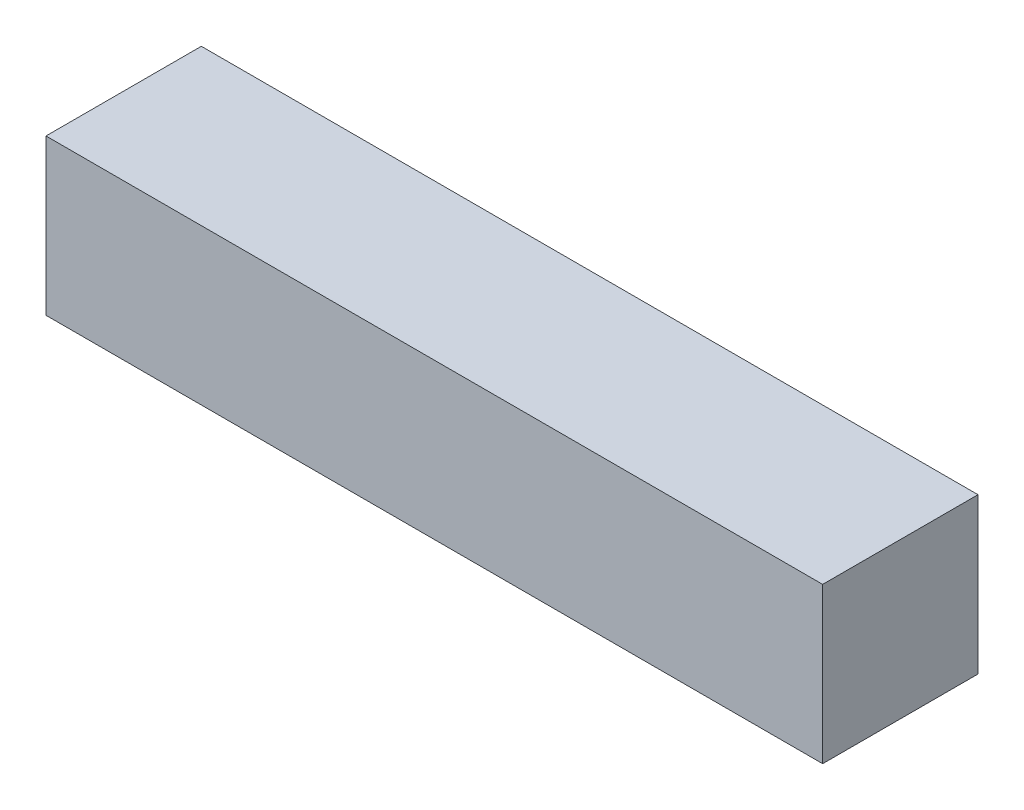
ISO-10303-21;
HEADER;
FILE_DESCRIPTION(('STEP AP214'),'2;1');
FILE_NAME('part.step','',(''),(''),'','','');
FILE_SCHEMA(('AUTOMOTIVE_DESIGN { 1 0 10303 214 1 1 1 1 }'));
ENDSEC;
DATA;
#1=APPLICATION_CONTEXT('core data for automotive mechanical design processes');
#2=APPLICATION_PROTOCOL_DEFINITION('international standard','automotive_design',2000,#1);
#3=PRODUCT_CONTEXT('',#1,'mechanical');
#4=PRODUCT('Part','Part','',(#3));
#5=PRODUCT_RELATED_PRODUCT_CATEGORY('part','',(#4));
#6=PRODUCT_DEFINITION_FORMATION('','',#4);
#7=PRODUCT_DEFINITION_CONTEXT('part definition',#1,'design');
#8=PRODUCT_DEFINITION('design','',#6,#7);
#9=PRODUCT_DEFINITION_SHAPE('','',#8);
#10=(LENGTH_UNIT() NAMED_UNIT(*) SI_UNIT(.MILLI.,.METRE.));
#11=(NAMED_UNIT(*) PLANE_ANGLE_UNIT() SI_UNIT($,.RADIAN.));
#12=(NAMED_UNIT(*) SI_UNIT($,.STERADIAN.) SOLID_ANGLE_UNIT());
#13=UNCERTAINTY_MEASURE_WITH_UNIT(LENGTH_MEASURE(1.E-05),#10,'distance_accuracy_value','');
#14=(GEOMETRIC_REPRESENTATION_CONTEXT(3) GLOBAL_UNCERTAINTY_ASSIGNED_CONTEXT((#13)) GLOBAL_UNIT_ASSIGNED_CONTEXT((#10,
#11,#12)) REPRESENTATION_CONTEXT('',''));
#15=CARTESIAN_POINT('',(0.,0.,0.));
#16=DIRECTION('',(0.,0.,1.));
#17=DIRECTION('',(1.,0.,0.));
#18=AXIS2_PLACEMENT_3D('',#15,#16,#17);
#19=CARTESIAN_POINT('',(127.,50.8,-25.4));
#20=DIRECTION('',(-1.,0.,0.));
#21=DIRECTION('',(0.,0.,1.));
#22=AXIS2_PLACEMENT_3D('',#19,#20,#21);
#23=PLANE('',#22);
#24=DIRECTION('',(0.,0.,-1.));
#25=VECTOR('',#24,1.);
#26=CARTESIAN_POINT('',(127.,0.,-25.4));
#27=LINE('',#26,#25);
#28=CARTESIAN_POINT('',(127.,0.,25.4));
#29=VERTEX_POINT('',#28);
#30=CARTESIAN_POINT('',(127.,0.,-25.4));
#31=VERTEX_POINT('',#30);
#32=EDGE_CURVE('E99',#29,#31,#27,.T.);
#33=ORIENTED_EDGE('',*,*,#32,.T.);
#34=DIRECTION('',(0.,-1.,0.));
#35=VECTOR('',#34,1.);
#36=CARTESIAN_POINT('',(127.,50.8,-25.4));
#37=LINE('',#36,#35);
#38=CARTESIAN_POINT('',(127.,50.8,-25.4));
#39=VERTEX_POINT('',#38);
#40=EDGE_CURVE('E11',#39,#31,#37,.T.);
#41=ORIENTED_EDGE('',*,*,#40,.F.);
#42=DIRECTION('',(0.,0.,-1.));
#43=VECTOR('',#42,1.);
#44=CARTESIAN_POINT('',(127.,50.8,-25.4));
#45=LINE('',#44,#43);
#46=CARTESIAN_POINT('',(127.,50.8,25.4));
#47=VERTEX_POINT('',#46);
#48=EDGE_CURVE('E87',#47,#39,#45,.T.);
#49=ORIENTED_EDGE('',*,*,#48,.F.);
#50=DIRECTION('',(0.,-1.,0.));
#51=VECTOR('',#50,1.);
#52=CARTESIAN_POINT('',(127.,50.8,25.4));
#53=LINE('',#52,#51);
#54=EDGE_CURVE('E95',#47,#29,#53,.T.);
#55=ORIENTED_EDGE('',*,*,#54,.T.);
#56=EDGE_LOOP('',(#33,#41,#49,#55));
#57=FACE_BOUND('',#56,.T.);
#58=ADVANCED_FACE('F36',(#57),#23,.F.);
#59=CARTESIAN_POINT('',(-127.,50.8,-25.4));
#60=DIRECTION('',(0.,0.,1.));
#61=DIRECTION('',(1.,0.,0.));
#62=AXIS2_PLACEMENT_3D('',#59,#60,#61);
#63=PLANE('',#62);
#64=DIRECTION('',(-1.,0.,0.));
#65=VECTOR('',#64,1.);
#66=CARTESIAN_POINT('',(-127.,0.,-25.4));
#67=LINE('',#66,#65);
#68=CARTESIAN_POINT('',(-127.,0.,-25.4));
#69=VERTEX_POINT('',#68);
#70=EDGE_CURVE('E91',#31,#69,#67,.T.);
#71=ORIENTED_EDGE('',*,*,#70,.T.);
#72=DIRECTION('',(0.,-1.,0.));
#73=VECTOR('',#72,1.);
#74=CARTESIAN_POINT('',(-127.,50.8,-25.4));
#75=LINE('',#74,#73);
#76=CARTESIAN_POINT('',(-127.,50.8,-25.4));
#77=VERTEX_POINT('',#76);
#78=EDGE_CURVE('E44',#77,#69,#75,.T.);
#79=ORIENTED_EDGE('',*,*,#78,.F.);
#80=DIRECTION('',(-1.,0.,0.));
#81=VECTOR('',#80,1.);
#82=CARTESIAN_POINT('',(-127.,50.8,-25.4));
#83=LINE('',#82,#81);
#84=EDGE_CURVE('E82',#39,#77,#83,.T.);
#85=ORIENTED_EDGE('',*,*,#84,.F.);
#86=ORIENTED_EDGE('',*,*,#40,.T.);
#87=EDGE_LOOP('',(#71,#79,#85,#86));
#88=FACE_BOUND('',#87,.T.);
#89=ADVANCED_FACE('F90',(#88),#63,.F.);
#90=CARTESIAN_POINT('',(-127.,50.8,-25.4));
#91=DIRECTION('',(1.,0.,0.));
#92=DIRECTION('',(0.,0.,-1.));
#93=AXIS2_PLACEMENT_3D('',#90,#91,#92);
#94=PLANE('',#93);
#95=DIRECTION('',(0.,0.,1.));
#96=VECTOR('',#95,1.);
#97=CARTESIAN_POINT('',(-127.,0.,-25.4));
#98=LINE('',#97,#96);
#99=CARTESIAN_POINT('',(-127.,0.,25.4));
#100=VERTEX_POINT('',#99);
#101=EDGE_CURVE('E69',#69,#100,#98,.T.);
#102=ORIENTED_EDGE('',*,*,#101,.T.);
#103=DIRECTION('',(0.,-1.,0.));
#104=VECTOR('',#103,1.);
#105=CARTESIAN_POINT('',(-127.,50.8,25.4));
#106=LINE('',#105,#104);
#107=CARTESIAN_POINT('',(-127.,50.8,25.4));
#108=VERTEX_POINT('',#107);
#109=EDGE_CURVE('E92',#108,#100,#106,.T.);
#110=ORIENTED_EDGE('',*,*,#109,.F.);
#111=DIRECTION('',(0.,0.,1.));
#112=VECTOR('',#111,1.);
#113=CARTESIAN_POINT('',(-127.,50.8,-25.4));
#114=LINE('',#113,#112);
#115=EDGE_CURVE('E85',#77,#108,#114,.T.);
#116=ORIENTED_EDGE('',*,*,#115,.F.);
#117=ORIENTED_EDGE('',*,*,#78,.T.);
#118=EDGE_LOOP('',(#102,#110,#116,#117));
#119=FACE_BOUND('',#118,.T.);
#120=ADVANCED_FACE('F93',(#119),#94,.F.);
#121=CARTESIAN_POINT('',(-127.,50.8,25.4));
#122=DIRECTION('',(0.,0.,-1.));
#123=DIRECTION('',(-1.,0.,0.));
#124=AXIS2_PLACEMENT_3D('',#121,#122,#123);
#125=PLANE('',#124);
#126=DIRECTION('',(1.,0.,0.));
#127=VECTOR('',#126,1.);
#128=CARTESIAN_POINT('',(-127.,0.,25.4));
#129=LINE('',#128,#127);
#130=EDGE_CURVE('E75',#100,#29,#129,.T.);
#131=ORIENTED_EDGE('',*,*,#130,.T.);
#132=ORIENTED_EDGE('',*,*,#54,.F.);
#133=DIRECTION('',(1.,0.,0.));
#134=VECTOR('',#133,1.);
#135=CARTESIAN_POINT('',(-127.,50.8,25.4));
#136=LINE('',#135,#134);
#137=EDGE_CURVE('E52',#108,#47,#136,.T.);
#138=ORIENTED_EDGE('',*,*,#137,.F.);
#139=ORIENTED_EDGE('',*,*,#109,.T.);
#140=EDGE_LOOP('',(#131,#132,#138,#139));
#141=FACE_BOUND('',#140,.T.);
#142=ADVANCED_FACE('F106',(#141),#125,.F.);
#143=CARTESIAN_POINT('',(0.,50.8,0.));
#144=DIRECTION('',(0.,1.,0.));
#145=DIRECTION('',(0.,0.,1.));
#146=AXIS2_PLACEMENT_3D('',#143,#144,#145);
#147=PLANE('',#146);
#148=ORIENTED_EDGE('',*,*,#48,.T.);
#149=ORIENTED_EDGE('',*,*,#84,.T.);
#150=ORIENTED_EDGE('',*,*,#115,.T.);
#151=ORIENTED_EDGE('',*,*,#137,.T.);
#152=EDGE_LOOP('',(#148,#149,#150,#151));
#153=FACE_BOUND('',#152,.T.);
#154=ADVANCED_FACE('F83',(#153),#147,.T.);
#155=CARTESIAN_POINT('',(0.,0.,0.));
#156=DIRECTION('',(0.,1.,0.));
#157=DIRECTION('',(0.,0.,1.));
#158=AXIS2_PLACEMENT_3D('',#155,#156,#157);
#159=PLANE('',#158);
#160=ORIENTED_EDGE('',*,*,#32,.F.);
#161=ORIENTED_EDGE('',*,*,#130,.F.);
#162=ORIENTED_EDGE('',*,*,#101,.F.);
#163=ORIENTED_EDGE('',*,*,#70,.F.);
#164=EDGE_LOOP('',(#160,#161,#162,#163));
#165=FACE_BOUND('',#164,.T.);
#166=ADVANCED_FACE('F109',(#165),#159,.F.);
#167=CLOSED_SHELL('',(#58,#89,#120,#142,#154,#166));
#168=MANIFOLD_SOLID_BREP('B2',#167);
#169=ADVANCED_BREP_SHAPE_REPRESENTATION('',(#18,#168),#14);
#170=SHAPE_DEFINITION_REPRESENTATION(#9,#169);
ENDSEC;
END-ISO-10303-21;
